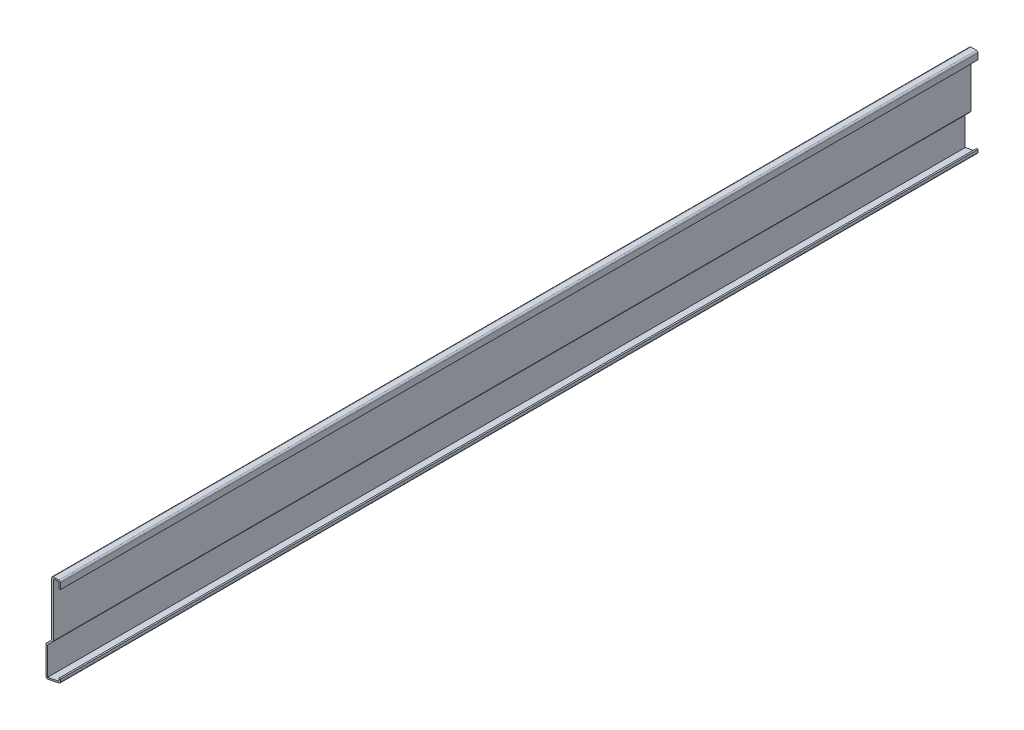
ISO-10303-21;
HEADER;
FILE_DESCRIPTION(('STEP AP214'),'2;1');
FILE_NAME('part.step','',(''),(''),'','','');
FILE_SCHEMA(('AUTOMOTIVE_DESIGN { 1 0 10303 214 1 1 1 1 }'));
ENDSEC;
DATA;
#1=APPLICATION_CONTEXT('core data for automotive mechanical design processes');
#2=APPLICATION_PROTOCOL_DEFINITION('international standard','automotive_design',2000,#1);
#3=PRODUCT_CONTEXT('',#1,'mechanical');
#4=PRODUCT('Part','Part','',(#3));
#5=PRODUCT_RELATED_PRODUCT_CATEGORY('part','',(#4));
#6=PRODUCT_DEFINITION_FORMATION('','',#4);
#7=PRODUCT_DEFINITION_CONTEXT('part definition',#1,'design');
#8=PRODUCT_DEFINITION('design','',#6,#7);
#9=PRODUCT_DEFINITION_SHAPE('','',#8);
#10=(LENGTH_UNIT() NAMED_UNIT(*) SI_UNIT(.MILLI.,.METRE.));
#11=(NAMED_UNIT(*) PLANE_ANGLE_UNIT() SI_UNIT($,.RADIAN.));
#12=(NAMED_UNIT(*) SI_UNIT($,.STERADIAN.) SOLID_ANGLE_UNIT());
#13=UNCERTAINTY_MEASURE_WITH_UNIT(LENGTH_MEASURE(1.E-05),#10,'distance_accuracy_value','');
#14=(GEOMETRIC_REPRESENTATION_CONTEXT(3) GLOBAL_UNCERTAINTY_ASSIGNED_CONTEXT((#13)) GLOBAL_UNIT_ASSIGNED_CONTEXT((#10,
#11,#12)) REPRESENTATION_CONTEXT('',''));
#15=CARTESIAN_POINT('',(0.,0.,0.));
#16=DIRECTION('',(0.,0.,1.));
#17=DIRECTION('',(1.,0.,0.));
#18=AXIS2_PLACEMENT_3D('',#15,#16,#17);
#19=CARTESIAN_POINT('',(0.,2.38125,-762.));
#20=DIRECTION('',(1.,0.,0.));
#21=DIRECTION('',(0.,1.,0.));
#22=AXIS2_PLACEMENT_3D('',#19,#20,#21);
#23=PLANE('',#22);
#24=DIRECTION('',(0.,1.,0.));
#25=VECTOR('',#24,1.);
#26=CARTESIAN_POINT('',(0.,2.38125,0.));
#27=LINE('',#26,#25);
#28=CARTESIAN_POINT('',(0.,3.42240095645257,0.));
#29=VERTEX_POINT('',#28);
#30=CARTESIAN_POINT('',(0.,5.55625,0.));
#31=VERTEX_POINT('',#30);
#32=EDGE_CURVE('E340',#29,#31,#27,.T.);
#33=ORIENTED_EDGE('',*,*,#32,.F.);
#34=DIRECTION('',(0.,0.,1.));
#35=VECTOR('',#34,1.);
#36=CARTESIAN_POINT('',(0.,3.42240095645257,-762.));
#37=LINE('',#36,#35);
#38=CARTESIAN_POINT('',(0.,3.42240095645257,-762.));
#39=VERTEX_POINT('',#38);
#40=EDGE_CURVE('E193',#29,#39,#37,.F.);
#41=ORIENTED_EDGE('',*,*,#40,.T.);
#42=DIRECTION('',(0.,1.,0.));
#43=VECTOR('',#42,1.);
#44=CARTESIAN_POINT('',(0.,2.38125,-762.));
#45=LINE('',#44,#43);
#46=CARTESIAN_POINT('',(0.,5.55625,-762.));
#47=VERTEX_POINT('',#46);
#48=EDGE_CURVE('E186',#39,#47,#45,.T.);
#49=ORIENTED_EDGE('',*,*,#48,.T.);
#50=DIRECTION('',(0.,0.,1.));
#51=VECTOR('',#50,1.);
#52=CARTESIAN_POINT('',(0.,5.55625,-762.));
#53=LINE('',#52,#51);
#54=EDGE_CURVE('E190',#47,#31,#53,.T.);
#55=ORIENTED_EDGE('',*,*,#54,.T.);
#56=EDGE_LOOP('',(#33,#41,#49,#55));
#57=FACE_BOUND('',#56,.T.);
#58=ADVANCED_FACE('F35',(#57),#23,.T.);
#59=CARTESIAN_POINT('',(-11.90625,0.,-762.));
#60=DIRECTION('',(0.196116135138184,-0.98058067569092,0.));
#61=DIRECTION('',(0.98058067569092,0.196116135138184,0.));
#62=AXIS2_PLACEMENT_3D('',#59,#60,#61);
#63=PLANE('',#62);
#64=DIRECTION('',(0.98058067569092,0.196116135138184,0.));
#65=VECTOR('',#64,1.);
#66=CARTESIAN_POINT('',(-11.90625,0.,-762.));
#67=LINE('',#66,#65);
#68=CARTESIAN_POINT('',(-10.3871825083745,0.303813498325099,-762.));
#69=VERTEX_POINT('',#68);
#70=CARTESIAN_POINT('',(-1.0209325083745,2.1770634983251,-762.));
#71=VERTEX_POINT('',#70);
#72=EDGE_CURVE('E210',#69,#71,#67,.T.);
#73=ORIENTED_EDGE('',*,*,#72,.T.);
#74=DIRECTION('',(0.,0.,1.));
#75=VECTOR('',#74,1.);
#76=CARTESIAN_POINT('',(-1.02093250837451,2.1770634983251,-762.));
#77=LINE('',#76,#75);
#78=CARTESIAN_POINT('',(-1.0209325083745,2.1770634983251,0.));
#79=VERTEX_POINT('',#78);
#80=EDGE_CURVE('E221',#71,#79,#77,.T.);
#81=ORIENTED_EDGE('',*,*,#80,.T.);
#82=DIRECTION('',(0.98058067569092,0.196116135138184,0.));
#83=VECTOR('',#82,1.);
#84=CARTESIAN_POINT('',(-11.90625,0.,0.));
#85=LINE('',#84,#83);
#86=CARTESIAN_POINT('',(-10.3871825083745,0.303813498325099,0.));
#87=VERTEX_POINT('',#86);
#88=EDGE_CURVE('E196',#87,#79,#85,.T.);
#89=ORIENTED_EDGE('',*,*,#88,.F.);
#90=DIRECTION('',(0.,0.,1.));
#91=VECTOR('',#90,1.);
#92=CARTESIAN_POINT('',(-10.3871825083745,0.303813498325099,-762.));
#93=LINE('',#92,#91);
#94=EDGE_CURVE('E219',#87,#69,#93,.F.);
#95=ORIENTED_EDGE('',*,*,#94,.T.);
#96=EDGE_LOOP('',(#73,#81,#89,#95));
#97=FACE_BOUND('',#96,.T.);
#98=ADVANCED_FACE('F395',(#97),#63,.T.);
#99=CARTESIAN_POINT('',(-11.90625,25.4,-762.));
#100=DIRECTION('',(-1.,0.,0.));
#101=DIRECTION('',(0.,-1.,0.));
#102=AXIS2_PLACEMENT_3D('',#99,#100,#101);
#103=PLANE('',#102);
#104=DIRECTION('',(0.,-1.,0.));
#105=VECTOR('',#104,1.);
#106=CARTESIAN_POINT('',(-11.90625,25.4,-762.));
#107=LINE('',#106,#105);
#108=CARTESIAN_POINT('',(-11.90625,24.8739487757862,-762.));
#109=VERTEX_POINT('',#108);
#110=CARTESIAN_POINT('',(-11.90625,1.54915095645257,-762.));
#111=VERTEX_POINT('',#110);
#112=EDGE_CURVE('E215',#109,#111,#107,.T.);
#113=ORIENTED_EDGE('',*,*,#112,.T.);
#114=DIRECTION('',(0.,0.,1.));
#115=VECTOR('',#114,1.);
#116=CARTESIAN_POINT('',(-11.90625,1.54915095645257,-762.));
#117=LINE('',#116,#115);
#118=CARTESIAN_POINT('',(-11.90625,1.54915095645257,0.));
#119=VERTEX_POINT('',#118);
#120=EDGE_CURVE('E251',#111,#119,#117,.T.);
#121=ORIENTED_EDGE('',*,*,#120,.T.);
#122=DIRECTION('',(0.,-1.,0.));
#123=VECTOR('',#122,1.);
#124=CARTESIAN_POINT('',(-11.90625,25.4,0.));
#125=LINE('',#124,#123);
#126=CARTESIAN_POINT('',(-11.90625,24.8739487757862,0.));
#127=VERTEX_POINT('',#126);
#128=EDGE_CURVE('E305',#127,#119,#125,.T.);
#129=ORIENTED_EDGE('',*,*,#128,.F.);
#130=DIRECTION('',(0.,0.,1.));
#131=VECTOR('',#130,1.);
#132=CARTESIAN_POINT('',(-11.90625,24.8739487757862,-762.));
#133=LINE('',#132,#131);
#134=EDGE_CURVE('E249',#127,#109,#133,.F.);
#135=ORIENTED_EDGE('',*,*,#134,.T.);
#136=EDGE_LOOP('',(#113,#121,#129,#135));
#137=FACE_BOUND('',#136,.T.);
#138=ADVANCED_FACE('F404',(#137),#103,.T.);
#139=CARTESIAN_POINT('',(-7.14375000000001,30.1625,-762.));
#140=DIRECTION('',(-0.707106781186547,0.707106781186547,0.));
#141=DIRECTION('',(-0.707106781186548,-0.707106781186548,0.));
#142=AXIS2_PLACEMENT_3D('',#139,#140,#141);
#143=PLANE('',#142);
#144=DIRECTION('',(-0.707106781186548,-0.707106781186548,0.));
#145=VECTOR('',#144,1.);
#146=CARTESIAN_POINT('',(-7.14375000000001,30.1625,-762.));
#147=LINE('',#146,#145);
#148=CARTESIAN_POINT('',(-7.14375000000001,30.1625,-762.));
#149=VERTEX_POINT('',#148);
#150=CARTESIAN_POINT('',(-11.5342756121069,25.7719743878931,-762.));
#151=VERTEX_POINT('',#150);
#152=EDGE_CURVE('E280',#149,#151,#147,.T.);
#153=ORIENTED_EDGE('',*,*,#152,.T.);
#154=DIRECTION('',(0.,0.,1.));
#155=VECTOR('',#154,1.);
#156=CARTESIAN_POINT('',(-11.5342756121069,25.7719743878931,-762.));
#157=LINE('',#156,#155);
#158=CARTESIAN_POINT('',(-11.5342756121069,25.7719743878931,0.));
#159=VERTEX_POINT('',#158);
#160=EDGE_CURVE('E254',#151,#159,#157,.T.);
#161=ORIENTED_EDGE('',*,*,#160,.T.);
#162=DIRECTION('',(-0.707106781186548,-0.707106781186548,0.));
#163=VECTOR('',#162,1.);
#164=CARTESIAN_POINT('',(-7.14375000000001,30.1625,0.));
#165=LINE('',#164,#163);
#166=CARTESIAN_POINT('',(-7.14375000000001,30.1625,0.));
#167=VERTEX_POINT('',#166);
#168=EDGE_CURVE('E297',#167,#159,#165,.T.);
#169=ORIENTED_EDGE('',*,*,#168,.F.);
#170=DIRECTION('',(0.,0.,1.));
#171=VECTOR('',#170,1.);
#172=CARTESIAN_POINT('',(-7.14375000000001,30.1625,-762.));
#173=LINE('',#172,#171);
#174=EDGE_CURVE('E222',#149,#167,#173,.T.);
#175=ORIENTED_EDGE('',*,*,#174,.F.);
#176=EDGE_LOOP('',(#153,#161,#169,#175));
#177=FACE_BOUND('',#176,.T.);
#178=ADVANCED_FACE('F411',(#177),#143,.T.);
#179=CARTESIAN_POINT('',(-7.14375000000001,76.2,-762.));
#180=DIRECTION('',(-1.,0.,0.));
#181=DIRECTION('',(0.,-1.,0.));
#182=AXIS2_PLACEMENT_3D('',#179,#180,#181);
#183=PLANE('',#182);
#184=DIRECTION('',(0.,-1.,0.));
#185=VECTOR('',#184,1.);
#186=CARTESIAN_POINT('',(-7.14375000000001,76.2,0.));
#187=LINE('',#186,#185);
#188=CARTESIAN_POINT('',(-7.14375000000001,74.93,0.));
#189=VERTEX_POINT('',#188);
#190=EDGE_CURVE('E273',#189,#167,#187,.T.);
#191=ORIENTED_EDGE('',*,*,#190,.F.);
#192=DIRECTION('',(0.,0.,1.));
#193=VECTOR('',#192,1.);
#194=CARTESIAN_POINT('',(-7.14375000000001,74.93,-762.));
#195=LINE('',#194,#193);
#196=CARTESIAN_POINT('',(-7.14375000000001,74.93,-762.));
#197=VERTEX_POINT('',#196);
#198=EDGE_CURVE('E43',#189,#197,#195,.F.);
#199=ORIENTED_EDGE('',*,*,#198,.T.);
#200=DIRECTION('',(0.,-1.,0.));
#201=VECTOR('',#200,1.);
#202=CARTESIAN_POINT('',(-7.14375000000001,76.2,-762.));
#203=LINE('',#202,#201);
#204=EDGE_CURVE('E271',#197,#149,#203,.T.);
#205=ORIENTED_EDGE('',*,*,#204,.T.);
#206=ORIENTED_EDGE('',*,*,#174,.T.);
#207=EDGE_LOOP('',(#191,#199,#205,#206));
#208=FACE_BOUND('',#207,.T.);
#209=ADVANCED_FACE('F269',(#208),#183,.T.);
#210=CARTESIAN_POINT('',(0.,76.2,-762.));
#211=DIRECTION('',(0.,1.,0.));
#212=DIRECTION('',(0.,0.,1.));
#213=AXIS2_PLACEMENT_3D('',#210,#211,#212);
#214=PLANE('',#213);
#215=DIRECTION('',(-1.,0.,0.));
#216=VECTOR('',#215,1.);
#217=CARTESIAN_POINT('',(0.,76.2,-762.));
#218=LINE('',#217,#216);
#219=CARTESIAN_POINT('',(-1.27,76.2,-762.));
#220=VERTEX_POINT('',#219);
#221=CARTESIAN_POINT('',(-5.87375000000001,76.2,-762.));
#222=VERTEX_POINT('',#221);
#223=EDGE_CURVE('E281',#220,#222,#218,.T.);
#224=ORIENTED_EDGE('',*,*,#223,.T.);
#225=DIRECTION('',(0.,0.,1.));
#226=VECTOR('',#225,1.);
#227=CARTESIAN_POINT('',(-5.87375000000001,76.2,-762.));
#228=LINE('',#227,#226);
#229=CARTESIAN_POINT('',(-5.87375000000001,76.2,0.));
#230=VERTEX_POINT('',#229);
#231=EDGE_CURVE('E263',#222,#230,#228,.T.);
#232=ORIENTED_EDGE('',*,*,#231,.T.);
#233=DIRECTION('',(-1.,0.,0.));
#234=VECTOR('',#233,1.);
#235=CARTESIAN_POINT('',(0.,76.2,0.));
#236=LINE('',#235,#234);
#237=CARTESIAN_POINT('',(-1.27,76.2,0.));
#238=VERTEX_POINT('',#237);
#239=EDGE_CURVE('E289',#238,#230,#236,.T.);
#240=ORIENTED_EDGE('',*,*,#239,.F.);
#241=DIRECTION('',(0.,0.,1.));
#242=VECTOR('',#241,1.);
#243=CARTESIAN_POINT('',(-1.27,76.2,-762.));
#244=LINE('',#243,#242);
#245=EDGE_CURVE('E261',#238,#220,#244,.F.);
#246=ORIENTED_EDGE('',*,*,#245,.T.);
#247=EDGE_LOOP('',(#224,#232,#240,#246));
#248=FACE_BOUND('',#247,.T.);
#249=ADVANCED_FACE('F288',(#248),#214,.T.);
#250=CARTESIAN_POINT('',(0.,69.85,-762.));
#251=DIRECTION('',(1.,0.,0.));
#252=DIRECTION('',(0.,1.,0.));
#253=AXIS2_PLACEMENT_3D('',#250,#251,#252);
#254=PLANE('',#253);
#255=DIRECTION('',(0.,1.,0.));
#256=VECTOR('',#255,1.);
#257=CARTESIAN_POINT('',(0.,69.85,-762.));
#258=LINE('',#257,#256);
#259=CARTESIAN_POINT('',(0.,69.85,-762.));
#260=VERTEX_POINT('',#259);
#261=CARTESIAN_POINT('',(0.,74.93,-762.));
#262=VERTEX_POINT('',#261);
#263=EDGE_CURVE('E383',#260,#262,#258,.T.);
#264=ORIENTED_EDGE('',*,*,#263,.T.);
#265=DIRECTION('',(0.,0.,1.));
#266=VECTOR('',#265,1.);
#267=CARTESIAN_POINT('',(0.,74.93,-762.));
#268=LINE('',#267,#266);
#269=CARTESIAN_POINT('',(0.,74.93,0.));
#270=VERTEX_POINT('',#269);
#271=EDGE_CURVE('E11',#262,#270,#268,.T.);
#272=ORIENTED_EDGE('',*,*,#271,.T.);
#273=DIRECTION('',(0.,1.,0.));
#274=VECTOR('',#273,1.);
#275=CARTESIAN_POINT('',(0.,69.85,0.));
#276=LINE('',#275,#274);
#277=CARTESIAN_POINT('',(0.,69.85,0.));
#278=VERTEX_POINT('',#277);
#279=EDGE_CURVE('E295',#278,#270,#276,.T.);
#280=ORIENTED_EDGE('',*,*,#279,.F.);
#281=DIRECTION('',(0.,0.,1.));
#282=VECTOR('',#281,1.);
#283=CARTESIAN_POINT('',(0.,69.85,-762.));
#284=LINE('',#283,#282);
#285=EDGE_CURVE('E310',#260,#278,#284,.T.);
#286=ORIENTED_EDGE('',*,*,#285,.F.);
#287=EDGE_LOOP('',(#264,#272,#280,#286));
#288=FACE_BOUND('',#287,.T.);
#289=ADVANCED_FACE('F450',(#288),#254,.T.);
#290=CARTESIAN_POINT('',(0.,69.85,-762.));
#291=DIRECTION('',(0.,1.,0.));
#292=DIRECTION('',(0.,0.,1.));
#293=AXIS2_PLACEMENT_3D('',#290,#291,#292);
#294=PLANE('',#293);
#295=DIRECTION('',(-1.,0.,0.));
#296=VECTOR('',#295,1.);
#297=CARTESIAN_POINT('',(0.,69.85,0.));
#298=LINE('',#297,#296);
#299=CARTESIAN_POINT('',(-1.27,69.85,0.));
#300=VERTEX_POINT('',#299);
#301=EDGE_CURVE('E299',#278,#300,#298,.T.);
#302=ORIENTED_EDGE('',*,*,#301,.T.);
#303=DIRECTION('',(0.,0.,1.));
#304=VECTOR('',#303,1.);
#305=CARTESIAN_POINT('',(-1.27,69.85,-762.));
#306=LINE('',#305,#304);
#307=CARTESIAN_POINT('',(-1.27,69.85,-762.));
#308=VERTEX_POINT('',#307);
#309=EDGE_CURVE('E312',#308,#300,#306,.T.);
#310=ORIENTED_EDGE('',*,*,#309,.F.);
#311=DIRECTION('',(-1.,0.,0.));
#312=VECTOR('',#311,1.);
#313=CARTESIAN_POINT('',(0.,69.85,-762.));
#314=LINE('',#313,#312);
#315=EDGE_CURVE('E381',#260,#308,#314,.T.);
#316=ORIENTED_EDGE('',*,*,#315,.F.);
#317=ORIENTED_EDGE('',*,*,#285,.T.);
#318=EDGE_LOOP('',(#302,#310,#316,#317));
#319=FACE_BOUND('',#318,.T.);
#320=ADVANCED_FACE('F355',(#319),#294,.F.);
#321=CARTESIAN_POINT('',(-1.27,69.85,-762.));
#322=DIRECTION('',(1.,0.,0.));
#323=DIRECTION('',(0.,1.,0.));
#324=AXIS2_PLACEMENT_3D('',#321,#322,#323);
#325=PLANE('',#324);
#326=DIRECTION('',(0.,1.,0.));
#327=VECTOR('',#326,1.);
#328=CARTESIAN_POINT('',(-1.27,69.85,0.));
#329=LINE('',#328,#327);
#330=CARTESIAN_POINT('',(-1.27,74.93,0.));
#331=VERTEX_POINT('',#330);
#332=EDGE_CURVE('E351',#300,#331,#329,.T.);
#333=ORIENTED_EDGE('',*,*,#332,.T.);
#334=DIRECTION('',(0.,0.,1.));
#335=VECTOR('',#334,1.);
#336=CARTESIAN_POINT('',(-1.27,74.93,-762.));
#337=LINE('',#336,#335);
#338=CARTESIAN_POINT('',(-1.27,74.93,-762.));
#339=VERTEX_POINT('',#338);
#340=EDGE_CURVE('E315',#339,#331,#337,.T.);
#341=ORIENTED_EDGE('',*,*,#340,.F.);
#342=DIRECTION('',(0.,1.,0.));
#343=VECTOR('',#342,1.);
#344=CARTESIAN_POINT('',(-1.27,69.85,-762.));
#345=LINE('',#344,#343);
#346=EDGE_CURVE('E363',#308,#339,#345,.T.);
#347=ORIENTED_EDGE('',*,*,#346,.F.);
#348=ORIENTED_EDGE('',*,*,#309,.T.);
#349=EDGE_LOOP('',(#333,#341,#347,#348));
#350=FACE_BOUND('',#349,.T.);
#351=ADVANCED_FACE('F361',(#350),#325,.F.);
#352=CARTESIAN_POINT('',(0.,74.93,-762.));
#353=DIRECTION('',(0.,1.,0.));
#354=DIRECTION('',(0.,0.,1.));
#355=AXIS2_PLACEMENT_3D('',#352,#353,#354);
#356=PLANE('',#355);
#357=DIRECTION('',(1.,0.,0.));
#358=VECTOR('',#357,1.);
#359=CARTESIAN_POINT('',(0.,74.93,0.));
#360=LINE('',#359,#358);
#361=CARTESIAN_POINT('',(-5.87375000000001,74.93,0.));
#362=VERTEX_POINT('',#361);
#363=EDGE_CURVE('E349',#331,#362,#360,.F.);
#364=ORIENTED_EDGE('',*,*,#363,.T.);
#365=DIRECTION('',(0.,0.,1.));
#366=VECTOR('',#365,1.);
#367=CARTESIAN_POINT('',(-5.87375000000001,74.93,-762.));
#368=LINE('',#367,#366);
#369=CARTESIAN_POINT('',(-5.87375000000001,74.93,-762.));
#370=VERTEX_POINT('',#369);
#371=EDGE_CURVE('E318',#370,#362,#368,.T.);
#372=ORIENTED_EDGE('',*,*,#371,.F.);
#373=DIRECTION('',(1.,0.,0.));
#374=VECTOR('',#373,1.);
#375=CARTESIAN_POINT('',(0.,74.93,-762.));
#376=LINE('',#375,#374);
#377=EDGE_CURVE('E372',#339,#370,#376,.F.);
#378=ORIENTED_EDGE('',*,*,#377,.F.);
#379=ORIENTED_EDGE('',*,*,#340,.T.);
#380=EDGE_LOOP('',(#364,#372,#378,#379));
#381=FACE_BOUND('',#380,.T.);
#382=ADVANCED_FACE('F368',(#381),#356,.F.);
#383=CARTESIAN_POINT('',(-5.87375000000001,76.2,-762.));
#384=DIRECTION('',(-1.,0.,0.));
#385=DIRECTION('',(0.,-1.,0.));
#386=AXIS2_PLACEMENT_3D('',#383,#384,#385);
#387=PLANE('',#386);
#388=DIRECTION('',(0.,-1.,0.));
#389=VECTOR('',#388,1.);
#390=CARTESIAN_POINT('',(-5.87375000000001,76.2,0.));
#391=LINE('',#390,#389);
#392=CARTESIAN_POINT('',(-5.87375000000001,30.1625,0.));
#393=VERTEX_POINT('',#392);
#394=EDGE_CURVE('E347',#362,#393,#391,.T.);
#395=ORIENTED_EDGE('',*,*,#394,.T.);
#396=DIRECTION('',(0.,0.,1.));
#397=VECTOR('',#396,1.);
#398=CARTESIAN_POINT('',(-5.87375000000001,30.1625,-762.));
#399=LINE('',#398,#397);
#400=CARTESIAN_POINT('',(-5.87375000000001,30.1625,-762.));
#401=VERTEX_POINT('',#400);
#402=EDGE_CURVE('E58',#393,#401,#399,.F.);
#403=ORIENTED_EDGE('',*,*,#402,.T.);
#404=DIRECTION('',(0.,-1.,0.));
#405=VECTOR('',#404,1.);
#406=CARTESIAN_POINT('',(-5.87375000000001,76.2,-762.));
#407=LINE('',#406,#405);
#408=EDGE_CURVE('E371',#370,#401,#407,.T.);
#409=ORIENTED_EDGE('',*,*,#408,.F.);
#410=ORIENTED_EDGE('',*,*,#371,.T.);
#411=EDGE_LOOP('',(#395,#403,#409,#410));
#412=FACE_BOUND('',#411,.T.);
#413=ADVANCED_FACE('F370',(#412),#387,.F.);
#414=CARTESIAN_POINT('',(-6.24572438789309,29.2644743878931,-762.));
#415=DIRECTION('',(-0.707106781186547,0.707106781186547,0.));
#416=DIRECTION('',(-0.707106781186548,-0.707106781186548,0.));
#417=AXIS2_PLACEMENT_3D('',#414,#415,#416);
#418=PLANE('',#417);
#419=DIRECTION('',(-0.707106781186548,-0.707106781186548,0.));
#420=VECTOR('',#419,1.);
#421=CARTESIAN_POINT('',(-6.24572438789309,29.2644743878931,-762.));
#422=LINE('',#421,#420);
#423=CARTESIAN_POINT('',(-6.24572438789309,29.2644743878931,-762.));
#424=VERTEX_POINT('',#423);
#425=CARTESIAN_POINT('',(-10.63625,24.8739487757862,-762.));
#426=VERTEX_POINT('',#425);
#427=EDGE_CURVE('E373',#424,#426,#422,.T.);
#428=ORIENTED_EDGE('',*,*,#427,.F.);
#429=DIRECTION('',(0.,0.,1.));
#430=VECTOR('',#429,1.);
#431=CARTESIAN_POINT('',(-6.24572438789309,29.2644743878931,-762.));
#432=LINE('',#431,#430);
#433=CARTESIAN_POINT('',(-6.24572438789309,29.2644743878931,0.));
#434=VERTEX_POINT('',#433);
#435=EDGE_CURVE('E257',#424,#434,#432,.T.);
#436=ORIENTED_EDGE('',*,*,#435,.T.);
#437=DIRECTION('',(-0.707106781186548,-0.707106781186548,0.));
#438=VECTOR('',#437,1.);
#439=CARTESIAN_POINT('',(-6.24572438789309,29.2644743878931,0.));
#440=LINE('',#439,#438);
#441=CARTESIAN_POINT('',(-10.63625,24.8739487757862,0.));
#442=VERTEX_POINT('',#441);
#443=EDGE_CURVE('E345',#434,#442,#440,.T.);
#444=ORIENTED_EDGE('',*,*,#443,.T.);
#445=DIRECTION('',(0.,0.,1.));
#446=VECTOR('',#445,1.);
#447=CARTESIAN_POINT('',(-10.63625,24.8739487757862,-762.));
#448=LINE('',#447,#446);
#449=EDGE_CURVE('E321',#426,#442,#448,.T.);
#450=ORIENTED_EDGE('',*,*,#449,.F.);
#451=EDGE_LOOP('',(#428,#436,#444,#450));
#452=FACE_BOUND('',#451,.T.);
#453=ADVANCED_FACE('F466',(#452),#418,.F.);
#454=CARTESIAN_POINT('',(-10.63625,25.4,-762.));
#455=DIRECTION('',(-1.,0.,0.));
#456=DIRECTION('',(0.,-1.,0.));
#457=AXIS2_PLACEMENT_3D('',#454,#455,#456);
#458=PLANE('',#457);
#459=DIRECTION('',(0.,-1.,0.));
#460=VECTOR('',#459,1.);
#461=CARTESIAN_POINT('',(-10.63625,25.4,0.));
#462=LINE('',#461,#460);
#463=CARTESIAN_POINT('',(-10.63625,1.54915095645257,0.));
#464=VERTEX_POINT('',#463);
#465=EDGE_CURVE('E338',#442,#464,#462,.T.);
#466=ORIENTED_EDGE('',*,*,#465,.T.);
#467=DIRECTION('',(0.,0.,1.));
#468=VECTOR('',#467,1.);
#469=CARTESIAN_POINT('',(-10.63625,1.54915095645257,-762.));
#470=LINE('',#469,#468);
#471=CARTESIAN_POINT('',(-10.63625,1.54915095645257,-762.));
#472=VERTEX_POINT('',#471);
#473=EDGE_CURVE('E324',#472,#464,#470,.T.);
#474=ORIENTED_EDGE('',*,*,#473,.F.);
#475=DIRECTION('',(0.,-1.,0.));
#476=VECTOR('',#475,1.);
#477=CARTESIAN_POINT('',(-10.63625,25.4,-762.));
#478=LINE('',#477,#476);
#479=EDGE_CURVE('E376',#426,#472,#478,.T.);
#480=ORIENTED_EDGE('',*,*,#479,.F.);
#481=ORIENTED_EDGE('',*,*,#449,.T.);
#482=EDGE_LOOP('',(#466,#474,#480,#481));
#483=FACE_BOUND('',#482,.T.);
#484=ADVANCED_FACE('F469',(#483),#458,.F.);
#485=CARTESIAN_POINT('',(-12.1553174916255,1.24533745812747,-762.));
#486=DIRECTION('',(0.196116135138184,-0.98058067569092,0.));
#487=DIRECTION('',(0.98058067569092,0.196116135138184,0.));
#488=AXIS2_PLACEMENT_3D('',#485,#486,#487);
#489=PLANE('',#488);
#490=DIRECTION('',(0.98058067569092,0.196116135138184,0.));
#491=VECTOR('',#490,1.);
#492=CARTESIAN_POINT('',(-12.1553174916255,1.24533745812747,0.));
#493=LINE('',#492,#491);
#494=CARTESIAN_POINT('',(-1.27,3.42240095645257,0.));
#495=VERTEX_POINT('',#494);
#496=EDGE_CURVE('E336',#464,#495,#493,.T.);
#497=ORIENTED_EDGE('',*,*,#496,.T.);
#498=DIRECTION('',(0.,0.,1.));
#499=VECTOR('',#498,1.);
#500=CARTESIAN_POINT('',(-1.27,3.42240095645257,-762.));
#501=LINE('',#500,#499);
#502=CARTESIAN_POINT('',(-1.27,3.42240095645257,-762.));
#503=VERTEX_POINT('',#502);
#504=EDGE_CURVE('E212',#503,#495,#501,.T.);
#505=ORIENTED_EDGE('',*,*,#504,.F.);
#506=DIRECTION('',(0.98058067569092,0.196116135138184,0.));
#507=VECTOR('',#506,1.);
#508=CARTESIAN_POINT('',(-12.1553174916255,1.24533745812747,-762.));
#509=LINE('',#508,#507);
#510=EDGE_CURVE('E619',#472,#503,#509,.T.);
#511=ORIENTED_EDGE('',*,*,#510,.F.);
#512=ORIENTED_EDGE('',*,*,#473,.T.);
#513=EDGE_LOOP('',(#497,#505,#511,#512));
#514=FACE_BOUND('',#513,.T.);
#515=ADVANCED_FACE('F473',(#514),#489,.F.);
#516=CARTESIAN_POINT('',(-1.27,2.38125,-762.));
#517=DIRECTION('',(1.,0.,0.));
#518=DIRECTION('',(0.,1.,0.));
#519=AXIS2_PLACEMENT_3D('',#516,#517,#518);
#520=PLANE('',#519);
#521=DIRECTION('',(0.,1.,0.));
#522=VECTOR('',#521,1.);
#523=CARTESIAN_POINT('',(-1.27,2.38125,0.));
#524=LINE('',#523,#522);
#525=CARTESIAN_POINT('',(-1.27,5.55625,0.));
#526=VERTEX_POINT('',#525);
#527=EDGE_CURVE('E331',#495,#526,#524,.T.);
#528=ORIENTED_EDGE('',*,*,#527,.T.);
#529=DIRECTION('',(0.,0.,1.));
#530=VECTOR('',#529,1.);
#531=CARTESIAN_POINT('',(-1.27,5.55625,-762.));
#532=LINE('',#531,#530);
#533=CARTESIAN_POINT('',(-1.27,5.55625,-762.));
#534=VERTEX_POINT('',#533);
#535=EDGE_CURVE('E209',#534,#526,#532,.T.);
#536=ORIENTED_EDGE('',*,*,#535,.F.);
#537=DIRECTION('',(0.,1.,0.));
#538=VECTOR('',#537,1.);
#539=CARTESIAN_POINT('',(-1.27,2.38125,-762.));
#540=LINE('',#539,#538);
#541=EDGE_CURVE('E201',#503,#534,#540,.T.);
#542=ORIENTED_EDGE('',*,*,#541,.F.);
#543=ORIENTED_EDGE('',*,*,#504,.T.);
#544=EDGE_LOOP('',(#528,#536,#542,#543));
#545=FACE_BOUND('',#544,.T.);
#546=ADVANCED_FACE('F330',(#545),#520,.F.);
#547=CARTESIAN_POINT('',(-1.27,5.55625,-762.));
#548=DIRECTION('',(0.,-1.,0.));
#549=DIRECTION('',(0.,0.,-1.));
#550=AXIS2_PLACEMENT_3D('',#547,#548,#549);
#551=PLANE('',#550);
#552=DIRECTION('',(1.,0.,0.));
#553=VECTOR('',#552,1.);
#554=CARTESIAN_POINT('',(-1.27,5.55625,0.));
#555=LINE('',#554,#553);
#556=EDGE_CURVE('E208',#526,#31,#555,.T.);
#557=ORIENTED_EDGE('',*,*,#556,.T.);
#558=ORIENTED_EDGE('',*,*,#54,.F.);
#559=DIRECTION('',(1.,0.,0.));
#560=VECTOR('',#559,1.);
#561=CARTESIAN_POINT('',(-1.27,5.55625,-762.));
#562=LINE('',#561,#560);
#563=EDGE_CURVE('E195',#534,#47,#562,.T.);
#564=ORIENTED_EDGE('',*,*,#563,.F.);
#565=ORIENTED_EDGE('',*,*,#535,.T.);
#566=EDGE_LOOP('',(#557,#558,#564,#565));
#567=FACE_BOUND('',#566,.T.);
#568=ADVANCED_FACE('F206',(#567),#551,.F.);
#569=CARTESIAN_POINT('',(0.,0.,-762.));
#570=DIRECTION('',(0.,0.,-1.));
#571=DIRECTION('',(-1.,0.,0.));
#572=AXIS2_PLACEMENT_3D('',#569,#570,#571);
#573=PLANE('',#572);
#574=ORIENTED_EDGE('',*,*,#48,.F.);
#575=CARTESIAN_POINT('',(-1.27,3.42240095645257,-762.));
#576=DIRECTION('',(0.,0.,-1.));
#577=DIRECTION('',(-1.,0.,0.));
#578=AXIS2_PLACEMENT_3D('',#575,#576,#577);
#579=CIRCLE('',#578,1.27);
#580=EDGE_CURVE('E247',#39,#71,#579,.T.);
#581=ORIENTED_EDGE('',*,*,#580,.T.);
#582=ORIENTED_EDGE('',*,*,#72,.F.);
#583=CARTESIAN_POINT('',(-10.63625,1.54915095645257,-762.));
#584=DIRECTION('',(0.,0.,-1.));
#585=DIRECTION('',(-1.,0.,0.));
#586=AXIS2_PLACEMENT_3D('',#583,#584,#585);
#587=CIRCLE('',#586,1.27);
#588=EDGE_CURVE('E245',#69,#111,#587,.T.);
#589=ORIENTED_EDGE('',*,*,#588,.T.);
#590=ORIENTED_EDGE('',*,*,#112,.F.);
#591=CARTESIAN_POINT('',(-10.63625,24.8739487757862,-762.));
#592=DIRECTION('',(0.,0.,-1.));
#593=DIRECTION('',(-1.,0.,0.));
#594=AXIS2_PLACEMENT_3D('',#591,#592,#593);
#595=CIRCLE('',#594,1.27);
#596=EDGE_CURVE('E243',#109,#151,#595,.T.);
#597=ORIENTED_EDGE('',*,*,#596,.T.);
#598=ORIENTED_EDGE('',*,*,#152,.F.);
#599=ORIENTED_EDGE('',*,*,#204,.F.);
#600=CARTESIAN_POINT('',(-5.87375000000001,74.93,-762.));
#601=DIRECTION('',(0.,0.,-1.));
#602=DIRECTION('',(-1.,0.,0.));
#603=AXIS2_PLACEMENT_3D('',#600,#601,#602);
#604=CIRCLE('',#603,1.27);
#605=EDGE_CURVE('E240',#197,#222,#604,.T.);
#606=ORIENTED_EDGE('',*,*,#605,.T.);
#607=ORIENTED_EDGE('',*,*,#223,.F.);
#608=CARTESIAN_POINT('',(-1.27,74.93,-762.));
#609=DIRECTION('',(0.,0.,-1.));
#610=DIRECTION('',(-1.,0.,0.));
#611=AXIS2_PLACEMENT_3D('',#608,#609,#610);
#612=CIRCLE('',#611,1.27);
#613=EDGE_CURVE('E238',#220,#262,#612,.T.);
#614=ORIENTED_EDGE('',*,*,#613,.T.);
#615=ORIENTED_EDGE('',*,*,#263,.F.);
#616=ORIENTED_EDGE('',*,*,#315,.T.);
#617=ORIENTED_EDGE('',*,*,#346,.T.);
#618=ORIENTED_EDGE('',*,*,#377,.T.);
#619=ORIENTED_EDGE('',*,*,#408,.T.);
#620=CARTESIAN_POINT('',(-7.14375000000001,30.1625,-762.));
#621=DIRECTION('',(0.,0.,-1.));
#622=DIRECTION('',(-1.,0.,0.));
#623=AXIS2_PLACEMENT_3D('',#620,#621,#622);
#624=CIRCLE('',#623,1.27);
#625=EDGE_CURVE('E50',#401,#424,#624,.T.);
#626=ORIENTED_EDGE('',*,*,#625,.T.);
#627=ORIENTED_EDGE('',*,*,#427,.T.);
#628=ORIENTED_EDGE('',*,*,#479,.T.);
#629=ORIENTED_EDGE('',*,*,#510,.T.);
#630=ORIENTED_EDGE('',*,*,#541,.T.);
#631=ORIENTED_EDGE('',*,*,#563,.T.);
#632=EDGE_LOOP('',(#574,#581,#582,#589,#590,#597,#598,#599,#606,#607,#614,#615,#616,#617,#618,
#619,#626,#627,#628,#629,#630,#631));
#633=FACE_BOUND('',#632,.T.);
#634=ADVANCED_FACE('F199',(#633),#573,.T.);
#635=CARTESIAN_POINT('',(0.,0.,0.));
#636=DIRECTION('',(0.,0.,-1.));
#637=DIRECTION('',(-1.,0.,0.));
#638=AXIS2_PLACEMENT_3D('',#635,#636,#637);
#639=PLANE('',#638);
#640=ORIENTED_EDGE('',*,*,#88,.T.);
#641=CARTESIAN_POINT('',(-1.27,3.42240095645257,0.));
#642=DIRECTION('',(0.,0.,-1.));
#643=DIRECTION('',(-1.,0.,0.));
#644=AXIS2_PLACEMENT_3D('',#641,#642,#643);
#645=CIRCLE('',#644,1.27);
#646=EDGE_CURVE('E235',#79,#29,#645,.F.);
#647=ORIENTED_EDGE('',*,*,#646,.T.);
#648=ORIENTED_EDGE('',*,*,#32,.T.);
#649=ORIENTED_EDGE('',*,*,#556,.F.);
#650=ORIENTED_EDGE('',*,*,#527,.F.);
#651=ORIENTED_EDGE('',*,*,#496,.F.);
#652=ORIENTED_EDGE('',*,*,#465,.F.);
#653=ORIENTED_EDGE('',*,*,#443,.F.);
#654=CARTESIAN_POINT('',(-7.14375000000001,30.1625,0.));
#655=DIRECTION('',(0.,0.,-1.));
#656=DIRECTION('',(-1.,0.,0.));
#657=AXIS2_PLACEMENT_3D('',#654,#655,#656);
#658=CIRCLE('',#657,1.27);
#659=EDGE_CURVE('E229',#434,#393,#658,.F.);
#660=ORIENTED_EDGE('',*,*,#659,.T.);
#661=ORIENTED_EDGE('',*,*,#394,.F.);
#662=ORIENTED_EDGE('',*,*,#363,.F.);
#663=ORIENTED_EDGE('',*,*,#332,.F.);
#664=ORIENTED_EDGE('',*,*,#301,.F.);
#665=ORIENTED_EDGE('',*,*,#279,.T.);
#666=CARTESIAN_POINT('',(-1.27,74.93,0.));
#667=DIRECTION('',(0.,0.,-1.));
#668=DIRECTION('',(-1.,0.,0.));
#669=AXIS2_PLACEMENT_3D('',#666,#667,#668);
#670=CIRCLE('',#669,1.27);
#671=EDGE_CURVE('E225',#270,#238,#670,.F.);
#672=ORIENTED_EDGE('',*,*,#671,.T.);
#673=ORIENTED_EDGE('',*,*,#239,.T.);
#674=CARTESIAN_POINT('',(-5.87375000000001,74.93,0.));
#675=DIRECTION('',(0.,0.,-1.));
#676=DIRECTION('',(-1.,0.,0.));
#677=AXIS2_PLACEMENT_3D('',#674,#675,#676);
#678=CIRCLE('',#677,1.27);
#679=EDGE_CURVE('E227',#230,#189,#678,.F.);
#680=ORIENTED_EDGE('',*,*,#679,.T.);
#681=ORIENTED_EDGE('',*,*,#190,.T.);
#682=ORIENTED_EDGE('',*,*,#168,.T.);
#683=CARTESIAN_POINT('',(-10.63625,24.8739487757862,0.));
#684=DIRECTION('',(0.,0.,-1.));
#685=DIRECTION('',(-1.,0.,0.));
#686=AXIS2_PLACEMENT_3D('',#683,#684,#685);
#687=CIRCLE('',#686,1.27);
#688=EDGE_CURVE('E231',#159,#127,#687,.F.);
#689=ORIENTED_EDGE('',*,*,#688,.T.);
#690=ORIENTED_EDGE('',*,*,#128,.T.);
#691=CARTESIAN_POINT('',(-10.63625,1.54915095645257,0.));
#692=DIRECTION('',(0.,0.,-1.));
#693=DIRECTION('',(-1.,0.,0.));
#694=AXIS2_PLACEMENT_3D('',#691,#692,#693);
#695=CIRCLE('',#694,1.27);
#696=EDGE_CURVE('E233',#119,#87,#695,.F.);
#697=ORIENTED_EDGE('',*,*,#696,.T.);
#698=EDGE_LOOP('',(#640,#647,#648,#649,#650,#651,#652,#653,#660,#661,#662,#663,#664,#665,#672,
#673,#680,#681,#682,#689,#690,#697));
#699=FACE_BOUND('',#698,.T.);
#700=ADVANCED_FACE('F293',(#699),#639,.F.);
#701=CARTESIAN_POINT('',(-1.27,3.42240095645257,-762.));
#702=DIRECTION('',(0.,0.,1.));
#703=DIRECTION('',(1.,0.,0.));
#704=AXIS2_PLACEMENT_3D('',#701,#702,#703);
#705=CYLINDRICAL_SURFACE('',#704,1.27);
#706=ORIENTED_EDGE('',*,*,#580,.F.);
#707=ORIENTED_EDGE('',*,*,#40,.F.);
#708=ORIENTED_EDGE('',*,*,#646,.F.);
#709=ORIENTED_EDGE('',*,*,#80,.F.);
#710=EDGE_LOOP('',(#706,#707,#708,#709));
#711=FACE_BOUND('',#710,.T.);
#712=ADVANCED_FACE('F390',(#711),#705,.T.);
#713=CARTESIAN_POINT('',(-10.63625,1.54915095645257,-762.));
#714=DIRECTION('',(0.,0.,1.));
#715=DIRECTION('',(1.,0.,0.));
#716=AXIS2_PLACEMENT_3D('',#713,#714,#715);
#717=CYLINDRICAL_SURFACE('',#716,1.27);
#718=ORIENTED_EDGE('',*,*,#588,.F.);
#719=ORIENTED_EDGE('',*,*,#94,.F.);
#720=ORIENTED_EDGE('',*,*,#696,.F.);
#721=ORIENTED_EDGE('',*,*,#120,.F.);
#722=EDGE_LOOP('',(#718,#719,#720,#721));
#723=FACE_BOUND('',#722,.T.);
#724=ADVANCED_FACE('F399',(#723),#717,.T.);
#725=CARTESIAN_POINT('',(-10.63625,24.8739487757862,-762.));
#726=DIRECTION('',(0.,0.,1.));
#727=DIRECTION('',(1.,0.,0.));
#728=AXIS2_PLACEMENT_3D('',#725,#726,#727);
#729=CYLINDRICAL_SURFACE('',#728,1.27);
#730=ORIENTED_EDGE('',*,*,#596,.F.);
#731=ORIENTED_EDGE('',*,*,#134,.F.);
#732=ORIENTED_EDGE('',*,*,#688,.F.);
#733=ORIENTED_EDGE('',*,*,#160,.F.);
#734=EDGE_LOOP('',(#730,#731,#732,#733));
#735=FACE_BOUND('',#734,.T.);
#736=ADVANCED_FACE('F408',(#735),#729,.T.);
#737=CARTESIAN_POINT('',(-7.14375000000001,30.1625,-762.));
#738=DIRECTION('',(0.,0.,1.));
#739=DIRECTION('',(1.,0.,0.));
#740=AXIS2_PLACEMENT_3D('',#737,#738,#739);
#741=CYLINDRICAL_SURFACE('',#740,1.27);
#742=ORIENTED_EDGE('',*,*,#625,.F.);
#743=ORIENTED_EDGE('',*,*,#402,.F.);
#744=ORIENTED_EDGE('',*,*,#659,.F.);
#745=ORIENTED_EDGE('',*,*,#435,.F.);
#746=EDGE_LOOP('',(#742,#743,#744,#745));
#747=FACE_BOUND('',#746,.T.);
#748=ADVANCED_FACE('F436',(#747),#741,.T.);
#749=CARTESIAN_POINT('',(-5.87375000000001,74.93,-762.));
#750=DIRECTION('',(0.,0.,1.));
#751=DIRECTION('',(1.,0.,0.));
#752=AXIS2_PLACEMENT_3D('',#749,#750,#751);
#753=CYLINDRICAL_SURFACE('',#752,1.27);
#754=ORIENTED_EDGE('',*,*,#605,.F.);
#755=ORIENTED_EDGE('',*,*,#198,.F.);
#756=ORIENTED_EDGE('',*,*,#679,.F.);
#757=ORIENTED_EDGE('',*,*,#231,.F.);
#758=EDGE_LOOP('',(#754,#755,#756,#757));
#759=FACE_BOUND('',#758,.T.);
#760=ADVANCED_FACE('F284',(#759),#753,.T.);
#761=CARTESIAN_POINT('',(-1.27,74.93,-762.));
#762=DIRECTION('',(0.,0.,1.));
#763=DIRECTION('',(1.,0.,0.));
#764=AXIS2_PLACEMENT_3D('',#761,#762,#763);
#765=CYLINDRICAL_SURFACE('',#764,1.27);
#766=ORIENTED_EDGE('',*,*,#613,.F.);
#767=ORIENTED_EDGE('',*,*,#245,.F.);
#768=ORIENTED_EDGE('',*,*,#671,.F.);
#769=ORIENTED_EDGE('',*,*,#271,.F.);
#770=EDGE_LOOP('',(#766,#767,#768,#769));
#771=FACE_BOUND('',#770,.T.);
#772=ADVANCED_FACE('F37',(#771),#765,.T.);
#773=CLOSED_SHELL('',(#58,#98,#138,#178,#209,#249,#289,#320,#351,#382,#413,#453,#484,#515,#546,
#568,#634,#700,#712,#724,#736,#748,#760,#772));
#774=MANIFOLD_SOLID_BREP('B2',#773);
#775=ADVANCED_BREP_SHAPE_REPRESENTATION('',(#18,#774),#14);
#776=SHAPE_DEFINITION_REPRESENTATION(#9,#775);
ENDSEC;
END-ISO-10303-21;
